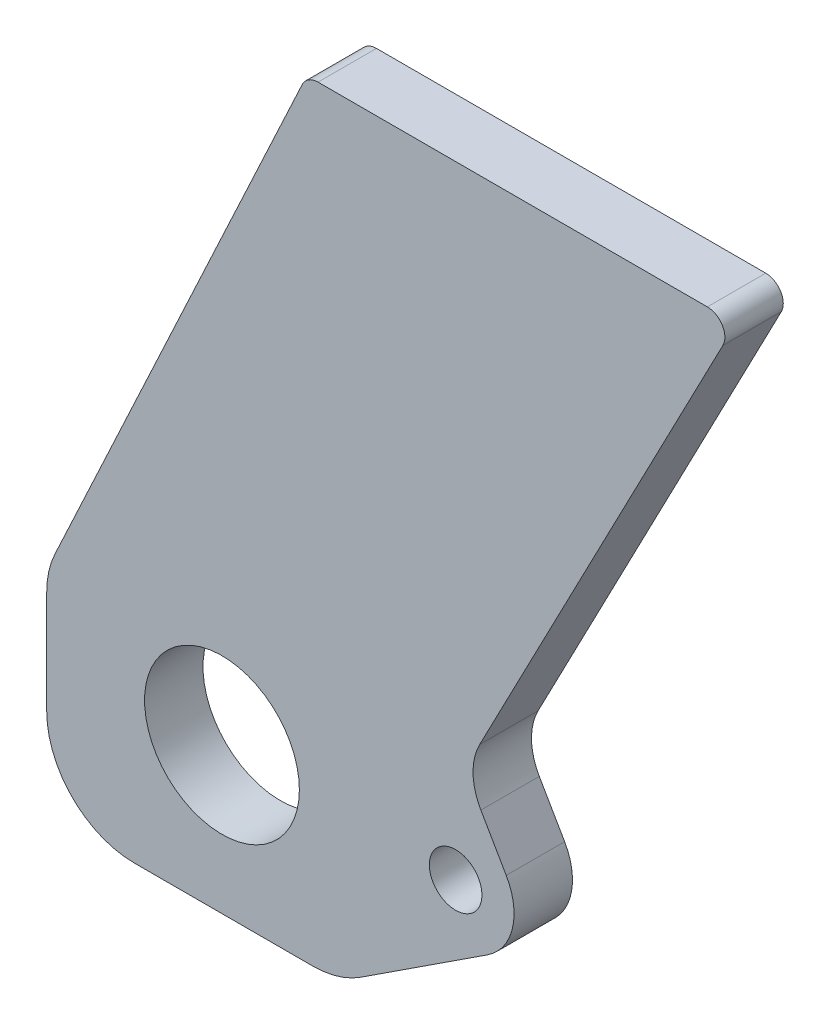
ISO-10303-21;
HEADER;
FILE_DESCRIPTION(('STEP AP214'),'2;1');
FILE_NAME('part.step','',(''),(''),'','','');
FILE_SCHEMA(('AUTOMOTIVE_DESIGN { 1 0 10303 214 1 1 1 1 }'));
ENDSEC;
DATA;
#1=APPLICATION_CONTEXT('core data for automotive mechanical design processes');
#2=APPLICATION_PROTOCOL_DEFINITION('international standard','automotive_design',2000,#1);
#3=PRODUCT_CONTEXT('',#1,'mechanical');
#4=PRODUCT('Part','Part','',(#3));
#5=PRODUCT_RELATED_PRODUCT_CATEGORY('part','',(#4));
#6=PRODUCT_DEFINITION_FORMATION('','',#4);
#7=PRODUCT_DEFINITION_CONTEXT('part definition',#1,'design');
#8=PRODUCT_DEFINITION('design','',#6,#7);
#9=PRODUCT_DEFINITION_SHAPE('','',#8);
#10=(LENGTH_UNIT() NAMED_UNIT(*) SI_UNIT(.MILLI.,.METRE.));
#11=(NAMED_UNIT(*) PLANE_ANGLE_UNIT() SI_UNIT($,.RADIAN.));
#12=(NAMED_UNIT(*) SI_UNIT($,.STERADIAN.) SOLID_ANGLE_UNIT());
#13=UNCERTAINTY_MEASURE_WITH_UNIT(LENGTH_MEASURE(1.E-05),#10,'distance_accuracy_value','');
#14=(GEOMETRIC_REPRESENTATION_CONTEXT(3) GLOBAL_UNCERTAINTY_ASSIGNED_CONTEXT((#13)) GLOBAL_UNIT_ASSIGNED_CONTEXT((#10,
#11,#12)) REPRESENTATION_CONTEXT('',''));
#15=CARTESIAN_POINT('',(0.,0.,0.));
#16=DIRECTION('',(0.,0.,1.));
#17=DIRECTION('',(1.,0.,0.));
#18=AXIS2_PLACEMENT_3D('',#15,#16,#17);
#19=CARTESIAN_POINT('',(40.,0.,10.));
#20=DIRECTION('',(0.,0.,-1.));
#21=DIRECTION('',(-1.,0.,0.));
#22=AXIS2_PLACEMENT_3D('',#19,#20,#21);
#23=PLANE('',#22);
#24=CARTESIAN_POINT('',(0.,0.,10.));
#25=DIRECTION('',(0.,0.,1.));
#26=DIRECTION('',(1.,0.,0.));
#27=AXIS2_PLACEMENT_3D('',#24,#25,#26);
#28=CIRCLE('',#27,13.25);
#29=CARTESIAN_POINT('',(13.25,0.,10.));
#30=VERTEX_POINT('',#29);
#31=EDGE_CURVE('E176',#30,#30,#28,.T.);
#32=ORIENTED_EDGE('',*,*,#31,.F.);
#33=EDGE_LOOP('',(#32));
#34=FACE_BOUND('',#33,.T.);
#35=CARTESIAN_POINT('',(40.,0.,10.));
#36=DIRECTION('',(0.,0.,1.));
#37=DIRECTION('',(-1.,0.,0.));
#38=AXIS2_PLACEMENT_3D('',#35,#36,#37);
#39=CIRCLE('',#38,10.);
#40=CARTESIAN_POINT('',(45.4667835735344,-8.37342685882754,10.));
#41=VERTEX_POINT('',#40);
#42=CARTESIAN_POINT('',(48.6602540378444,4.99999999999998,10.));
#43=VERTEX_POINT('',#42);
#44=EDGE_CURVE('E199',#41,#43,#39,.T.);
#45=ORIENTED_EDGE('',*,*,#44,.T.);
#46=DIRECTION('',(-0.499999999999998,0.86602540378444,0.));
#47=VECTOR('',#46,1.);
#48=CARTESIAN_POINT('',(48.6602540378444,4.99999999999998,10.));
#49=LINE('',#48,#47);
#50=CARTESIAN_POINT('',(44.3224243689384,12.5133413811249,10.));
#51=VERTEX_POINT('',#50);
#52=EDGE_CURVE('E117',#43,#51,#49,.T.);
#53=ORIENTED_EDGE('',*,*,#52,.T.);
#54=CARTESIAN_POINT('',(52.9826784067828,17.5133413811249,10.));
#55=DIRECTION('',(0.,0.,-1.));
#56=DIRECTION('',(1.,0.,0.));
#57=AXIS2_PLACEMENT_3D('',#54,#55,#56);
#58=CIRCLE('',#57,10.);
#59=CARTESIAN_POINT('',(44.1125700750005,22.1308275134752,10.));
#60=VERTEX_POINT('',#59);
#61=EDGE_CURVE('E232',#51,#60,#58,.T.);
#62=ORIENTED_EDGE('',*,*,#61,.T.);
#63=DIRECTION('',(0.461748613235028,0.887010833178225,0.));
#64=VECTOR('',#63,1.);
#65=CARTESIAN_POINT('',(44.1125700750005,22.1308275134752,10.));
#66=LINE('',#65,#64);
#67=CARTESIAN_POINT('',(85.749566861082,102.114754160295,10.));
#68=VERTEX_POINT('',#67);
#69=EDGE_CURVE('E251',#60,#68,#66,.T.);
#70=ORIENTED_EDGE('',*,*,#69,.T.);
#71=CARTESIAN_POINT('',(83.0885343615474,103.5,10.));
#72=DIRECTION('',(0.,0.,1.));
#73=DIRECTION('',(-1.,0.,0.));
#74=AXIS2_PLACEMENT_3D('',#71,#72,#73);
#75=CIRCLE('',#74,3.);
#76=CARTESIAN_POINT('',(83.0885343615474,106.5,10.));
#77=VERTEX_POINT('',#76);
#78=EDGE_CURVE('E248',#68,#77,#75,.T.);
#79=ORIENTED_EDGE('',*,*,#78,.T.);
#80=DIRECTION('',(-1.,0.,0.));
#81=VECTOR('',#80,1.);
#82=CARTESIAN_POINT('',(16.4435921362241,106.5,10.));
#83=LINE('',#82,#81);
#84=CARTESIAN_POINT('',(16.4435921362241,106.5,10.));
#85=VERTEX_POINT('',#84);
#86=EDGE_CURVE('E250',#77,#85,#83,.T.);
#87=ORIENTED_EDGE('',*,*,#86,.T.);
#88=CARTESIAN_POINT('',(16.4435921362241,103.5,10.));
#89=DIRECTION('',(0.,0.,1.));
#90=DIRECTION('',(-1.,0.,0.));
#91=AXIS2_PLACEMENT_3D('',#88,#89,#90);
#92=CIRCLE('',#91,3.);
#93=CARTESIAN_POINT('',(13.7246687751141,104.767854785222,10.));
#94=VERTEX_POINT('',#93);
#95=EDGE_CURVE('E253',#85,#94,#92,.T.);
#96=ORIENTED_EDGE('',*,*,#95,.T.);
#97=DIRECTION('',(-0.422618261740694,-0.906307787036653,0.));
#98=VECTOR('',#97,1.);
#99=CARTESIAN_POINT('',(-28.5946168055498,14.0138539864663,10.));
#100=LINE('',#99,#98);
#101=CARTESIAN_POINT('',(-28.5946168055498,14.0138539864663,10.));
#102=VERTEX_POINT('',#101);
#103=EDGE_CURVE('E259',#94,#102,#100,.T.);
#104=ORIENTED_EDGE('',*,*,#103,.T.);
#105=CARTESIAN_POINT('',(-15.,7.67458006035594,10.));
#106=DIRECTION('',(0.,0.,1.));
#107=DIRECTION('',(1.,0.,0.));
#108=AXIS2_PLACEMENT_3D('',#105,#106,#107);
#109=CIRCLE('',#108,15.);
#110=CARTESIAN_POINT('',(-30.,7.67458006035594,10.));
#111=VERTEX_POINT('',#110);
#112=EDGE_CURVE('E261',#102,#111,#109,.T.);
#113=ORIENTED_EDGE('',*,*,#112,.T.);
#114=DIRECTION('',(0.,-1.,0.));
#115=VECTOR('',#114,1.);
#116=CARTESIAN_POINT('',(-30.,7.67458006035594,10.));
#117=LINE('',#116,#115);
#118=CARTESIAN_POINT('',(-30.,-10.,10.));
#119=VERTEX_POINT('',#118);
#120=EDGE_CURVE('E263',#111,#119,#117,.T.);
#121=ORIENTED_EDGE('',*,*,#120,.T.);
#122=CARTESIAN_POINT('',(-15.,-10.,10.));
#123=DIRECTION('',(0.,0.,1.));
#124=DIRECTION('',(1.,0.,0.));
#125=AXIS2_PLACEMENT_3D('',#122,#123,#124);
#126=CIRCLE('',#125,15.);
#127=CARTESIAN_POINT('',(-15.,-25.,10.));
#128=VERTEX_POINT('',#127);
#129=EDGE_CURVE('E154',#119,#128,#126,.T.);
#130=ORIENTED_EDGE('',*,*,#129,.T.);
#131=DIRECTION('',(1.,0.,0.));
#132=VECTOR('',#131,1.);
#133=CARTESIAN_POINT('',(15.5369374350752,-25.,10.));
#134=LINE('',#133,#132);
#135=CARTESIAN_POINT('',(15.5369374350752,-25.,10.));
#136=VERTEX_POINT('',#135);
#137=EDGE_CURVE('E148',#128,#136,#134,.T.);
#138=ORIENTED_EDGE('',*,*,#137,.T.);
#139=CARTESIAN_POINT('',(15.5369374350753,-9.99999999999999,10.));
#140=DIRECTION('',(0.,0.,1.));
#141=DIRECTION('',(-1.,0.,0.));
#142=AXIS2_PLACEMENT_3D('',#139,#140,#141);
#143=CIRCLE('',#142,15.);
#144=CARTESIAN_POINT('',(23.7371127953769,-22.5601402882413,10.));
#145=VERTEX_POINT('',#144);
#146=EDGE_CURVE('E152',#136,#145,#143,.T.);
#147=ORIENTED_EDGE('',*,*,#146,.T.);
#148=DIRECTION('',(0.837342685882753,0.546678357353441,0.));
#149=VECTOR('',#148,1.);
#150=CARTESIAN_POINT('',(45.4667835735344,-8.37342685882754,10.));
#151=LINE('',#150,#149);
#152=EDGE_CURVE('E56',#145,#41,#151,.T.);
#153=ORIENTED_EDGE('',*,*,#152,.T.);
#154=EDGE_LOOP('',(#45,#53,#62,#70,#79,#87,#96,#104,#113,#121,#130,#138,#147,#153));
#155=FACE_BOUND('',#154,.T.);
#156=CARTESIAN_POINT('',(40.,0.,10.));
#157=DIRECTION('',(0.,0.,1.));
#158=DIRECTION('',(1.,0.,0.));
#159=AXIS2_PLACEMENT_3D('',#156,#157,#158);
#160=CIRCLE('',#159,4.5);
#161=CARTESIAN_POINT('',(44.5,0.,10.));
#162=VERTEX_POINT('',#161);
#163=EDGE_CURVE('E306',#162,#162,#160,.T.);
#164=ORIENTED_EDGE('',*,*,#163,.F.);
#165=EDGE_LOOP('',(#164));
#166=FACE_BOUND('',#165,.T.);
#167=ADVANCED_FACE('F39',(#34,#155,#166),#23,.F.);
#168=CARTESIAN_POINT('',(40.,0.,0.));
#169=DIRECTION('',(0.,0.,-1.));
#170=DIRECTION('',(-1.,0.,0.));
#171=AXIS2_PLACEMENT_3D('',#168,#169,#170);
#172=PLANE('',#171);
#173=CARTESIAN_POINT('',(0.,0.,0.));
#174=DIRECTION('',(0.,0.,1.));
#175=DIRECTION('',(1.,0.,0.));
#176=AXIS2_PLACEMENT_3D('',#173,#174,#175);
#177=CIRCLE('',#176,13.25);
#178=CARTESIAN_POINT('',(13.25,0.,0.));
#179=VERTEX_POINT('',#178);
#180=EDGE_CURVE('E311',#179,#179,#177,.T.);
#181=ORIENTED_EDGE('',*,*,#180,.T.);
#182=EDGE_LOOP('',(#181));
#183=FACE_BOUND('',#182,.T.);
#184=CARTESIAN_POINT('',(40.,0.,0.));
#185=DIRECTION('',(0.,0.,1.));
#186=DIRECTION('',(-1.,0.,0.));
#187=AXIS2_PLACEMENT_3D('',#184,#185,#186);
#188=CIRCLE('',#187,10.);
#189=CARTESIAN_POINT('',(45.4667835735344,-8.37342685882754,0.));
#190=VERTEX_POINT('',#189);
#191=CARTESIAN_POINT('',(48.6602540378444,4.99999999999998,0.));
#192=VERTEX_POINT('',#191);
#193=EDGE_CURVE('E172',#190,#192,#188,.T.);
#194=ORIENTED_EDGE('',*,*,#193,.F.);
#195=DIRECTION('',(0.837342685882753,0.546678357353441,0.));
#196=VECTOR('',#195,1.);
#197=CARTESIAN_POINT('',(45.4667835735344,-8.37342685882754,0.));
#198=LINE('',#197,#196);
#199=CARTESIAN_POINT('',(23.7371127953769,-22.5601402882413,0.));
#200=VERTEX_POINT('',#199);
#201=EDGE_CURVE('E109',#200,#190,#198,.T.);
#202=ORIENTED_EDGE('',*,*,#201,.F.);
#203=CARTESIAN_POINT('',(15.5369374350753,-9.99999999999999,0.));
#204=DIRECTION('',(0.,0.,1.));
#205=DIRECTION('',(-1.,0.,0.));
#206=AXIS2_PLACEMENT_3D('',#203,#204,#205);
#207=CIRCLE('',#206,15.);
#208=CARTESIAN_POINT('',(15.5369374350752,-25.,0.));
#209=VERTEX_POINT('',#208);
#210=EDGE_CURVE('E103',#209,#200,#207,.T.);
#211=ORIENTED_EDGE('',*,*,#210,.F.);
#212=DIRECTION('',(1.,0.,0.));
#213=VECTOR('',#212,1.);
#214=CARTESIAN_POINT('',(15.5369374350752,-25.,0.));
#215=LINE('',#214,#213);
#216=CARTESIAN_POINT('',(-15.,-25.,0.));
#217=VERTEX_POINT('',#216);
#218=EDGE_CURVE('E162',#217,#209,#215,.T.);
#219=ORIENTED_EDGE('',*,*,#218,.F.);
#220=CARTESIAN_POINT('',(-15.,-10.,0.));
#221=DIRECTION('',(0.,0.,1.));
#222=DIRECTION('',(1.,0.,0.));
#223=AXIS2_PLACEMENT_3D('',#220,#221,#222);
#224=CIRCLE('',#223,15.);
#225=CARTESIAN_POINT('',(-30.,-10.,0.));
#226=VERTEX_POINT('',#225);
#227=EDGE_CURVE('E194',#226,#217,#224,.T.);
#228=ORIENTED_EDGE('',*,*,#227,.F.);
#229=DIRECTION('',(0.,-1.,0.));
#230=VECTOR('',#229,1.);
#231=CARTESIAN_POINT('',(-30.,7.67458006035594,0.));
#232=LINE('',#231,#230);
#233=CARTESIAN_POINT('',(-30.,7.67458006035594,0.));
#234=VERTEX_POINT('',#233);
#235=EDGE_CURVE('E192',#234,#226,#232,.T.);
#236=ORIENTED_EDGE('',*,*,#235,.F.);
#237=CARTESIAN_POINT('',(-15.,7.67458006035594,0.));
#238=DIRECTION('',(0.,0.,1.));
#239=DIRECTION('',(1.,0.,0.));
#240=AXIS2_PLACEMENT_3D('',#237,#238,#239);
#241=CIRCLE('',#240,15.);
#242=CARTESIAN_POINT('',(-28.5946168055498,14.0138539864663,0.));
#243=VERTEX_POINT('',#242);
#244=EDGE_CURVE('E190',#243,#234,#241,.T.);
#245=ORIENTED_EDGE('',*,*,#244,.F.);
#246=DIRECTION('',(-0.422618261740694,-0.906307787036653,0.));
#247=VECTOR('',#246,1.);
#248=CARTESIAN_POINT('',(-28.5946168055498,14.0138539864663,0.));
#249=LINE('',#248,#247);
#250=CARTESIAN_POINT('',(13.7246687751141,104.767854785222,0.));
#251=VERTEX_POINT('',#250);
#252=EDGE_CURVE('E188',#251,#243,#249,.T.);
#253=ORIENTED_EDGE('',*,*,#252,.F.);
#254=CARTESIAN_POINT('',(16.4435921362241,103.5,0.));
#255=DIRECTION('',(0.,0.,1.));
#256=DIRECTION('',(-1.,0.,0.));
#257=AXIS2_PLACEMENT_3D('',#254,#255,#256);
#258=CIRCLE('',#257,3.);
#259=CARTESIAN_POINT('',(16.4435921362241,106.5,0.));
#260=VERTEX_POINT('',#259);
#261=EDGE_CURVE('E186',#260,#251,#258,.T.);
#262=ORIENTED_EDGE('',*,*,#261,.F.);
#263=DIRECTION('',(-1.,0.,0.));
#264=VECTOR('',#263,1.);
#265=CARTESIAN_POINT('',(16.4435921362241,106.5,0.));
#266=LINE('',#265,#264);
#267=CARTESIAN_POINT('',(83.0885343615474,106.5,0.));
#268=VERTEX_POINT('',#267);
#269=EDGE_CURVE('E184',#268,#260,#266,.T.);
#270=ORIENTED_EDGE('',*,*,#269,.F.);
#271=CARTESIAN_POINT('',(83.0885343615474,103.5,0.));
#272=DIRECTION('',(0.,0.,1.));
#273=DIRECTION('',(-1.,0.,0.));
#274=AXIS2_PLACEMENT_3D('',#271,#272,#273);
#275=CIRCLE('',#274,3.);
#276=CARTESIAN_POINT('',(85.749566861082,102.114754160295,0.));
#277=VERTEX_POINT('',#276);
#278=EDGE_CURVE('E182',#277,#268,#275,.T.);
#279=ORIENTED_EDGE('',*,*,#278,.F.);
#280=DIRECTION('',(0.461748613235028,0.887010833178225,0.));
#281=VECTOR('',#280,1.);
#282=CARTESIAN_POINT('',(44.1125700750005,22.1308275134752,0.));
#283=LINE('',#282,#281);
#284=CARTESIAN_POINT('',(44.1125700750005,22.1308275134752,0.));
#285=VERTEX_POINT('',#284);
#286=EDGE_CURVE('E180',#285,#277,#283,.T.);
#287=ORIENTED_EDGE('',*,*,#286,.F.);
#288=CARTESIAN_POINT('',(52.9826784067828,17.5133413811249,0.));
#289=DIRECTION('',(0.,0.,-1.));
#290=DIRECTION('',(1.,0.,0.));
#291=AXIS2_PLACEMENT_3D('',#288,#289,#290);
#292=CIRCLE('',#291,10.);
#293=CARTESIAN_POINT('',(44.3224243689384,12.5133413811249,0.));
#294=VERTEX_POINT('',#293);
#295=EDGE_CURVE('E178',#294,#285,#292,.T.);
#296=ORIENTED_EDGE('',*,*,#295,.F.);
#297=DIRECTION('',(-0.499999999999998,0.86602540378444,0.));
#298=VECTOR('',#297,1.);
#299=CARTESIAN_POINT('',(48.6602540378444,4.99999999999998,0.));
#300=LINE('',#299,#298);
#301=EDGE_CURVE('E175',#192,#294,#300,.T.);
#302=ORIENTED_EDGE('',*,*,#301,.F.);
#303=EDGE_LOOP('',(#194,#202,#211,#219,#228,#236,#245,#253,#262,#270,#279,#287,#296,#302));
#304=FACE_BOUND('',#303,.T.);
#305=CARTESIAN_POINT('',(40.,0.,0.));
#306=DIRECTION('',(0.,0.,1.));
#307=DIRECTION('',(1.,0.,0.));
#308=AXIS2_PLACEMENT_3D('',#305,#306,#307);
#309=CIRCLE('',#308,4.5);
#310=CARTESIAN_POINT('',(44.5,0.,0.));
#311=VERTEX_POINT('',#310);
#312=EDGE_CURVE('E309',#311,#311,#309,.T.);
#313=ORIENTED_EDGE('',*,*,#312,.T.);
#314=EDGE_LOOP('',(#313));
#315=FACE_BOUND('',#314,.T.);
#316=ADVANCED_FACE('F236',(#183,#304,#315),#172,.T.);
#317=CARTESIAN_POINT('',(40.,0.,10.));
#318=DIRECTION('',(0.,0.,-1.));
#319=DIRECTION('',(-1.,0.,0.));
#320=AXIS2_PLACEMENT_3D('',#317,#318,#319);
#321=CYLINDRICAL_SURFACE('',#320,10.);
#322=ORIENTED_EDGE('',*,*,#193,.T.);
#323=DIRECTION('',(0.,0.,-1.));
#324=VECTOR('',#323,1.);
#325=CARTESIAN_POINT('',(48.6602540378444,4.99999999999998,10.));
#326=LINE('',#325,#324);
#327=EDGE_CURVE('E11',#43,#192,#326,.T.);
#328=ORIENTED_EDGE('',*,*,#327,.F.);
#329=ORIENTED_EDGE('',*,*,#44,.F.);
#330=DIRECTION('',(0.,0.,-1.));
#331=VECTOR('',#330,1.);
#332=CARTESIAN_POINT('',(45.4667835735344,-8.37342685882754,10.));
#333=LINE('',#332,#331);
#334=EDGE_CURVE('E168',#41,#190,#333,.T.);
#335=ORIENTED_EDGE('',*,*,#334,.T.);
#336=EDGE_LOOP('',(#322,#328,#329,#335));
#337=FACE_BOUND('',#336,.T.);
#338=ADVANCED_FACE('F41',(#337),#321,.T.);
#339=CARTESIAN_POINT('',(48.6602540378444,4.99999999999998,10.));
#340=DIRECTION('',(-0.86602540378444,-0.499999999999998,0.));
#341=DIRECTION('',(0.499999999999998,-0.86602540378444,0.));
#342=AXIS2_PLACEMENT_3D('',#339,#340,#341);
#343=PLANE('',#342);
#344=ORIENTED_EDGE('',*,*,#301,.T.);
#345=DIRECTION('',(0.,0.,-1.));
#346=VECTOR('',#345,1.);
#347=CARTESIAN_POINT('',(44.3224243689384,12.5133413811249,10.));
#348=LINE('',#347,#346);
#349=EDGE_CURVE('E48',#51,#294,#348,.T.);
#350=ORIENTED_EDGE('',*,*,#349,.F.);
#351=ORIENTED_EDGE('',*,*,#52,.F.);
#352=ORIENTED_EDGE('',*,*,#327,.T.);
#353=EDGE_LOOP('',(#344,#350,#351,#352));
#354=FACE_BOUND('',#353,.T.);
#355=ADVANCED_FACE('F400',(#354),#343,.F.);
#356=CARTESIAN_POINT('',(52.9826784067828,17.5133413811249,10.));
#357=DIRECTION('',(0.,0.,-1.));
#358=DIRECTION('',(-1.,0.,0.));
#359=AXIS2_PLACEMENT_3D('',#356,#357,#358);
#360=CYLINDRICAL_SURFACE('',#359,10.);
#361=ORIENTED_EDGE('',*,*,#295,.T.);
#362=DIRECTION('',(0.,0.,-1.));
#363=VECTOR('',#362,1.);
#364=CARTESIAN_POINT('',(44.1125700750005,22.1308275134752,10.));
#365=LINE('',#364,#363);
#366=EDGE_CURVE('E224',#60,#285,#365,.T.);
#367=ORIENTED_EDGE('',*,*,#366,.F.);
#368=ORIENTED_EDGE('',*,*,#61,.F.);
#369=ORIENTED_EDGE('',*,*,#349,.T.);
#370=EDGE_LOOP('',(#361,#367,#368,#369));
#371=FACE_BOUND('',#370,.T.);
#372=ADVANCED_FACE('F230',(#371),#360,.F.);
#373=CARTESIAN_POINT('',(44.1125700750005,22.1308275134752,10.));
#374=DIRECTION('',(-0.887010833178225,0.461748613235028,0.));
#375=DIRECTION('',(-0.461748613235028,-0.887010833178225,0.));
#376=AXIS2_PLACEMENT_3D('',#373,#374,#375);
#377=PLANE('',#376);
#378=ORIENTED_EDGE('',*,*,#286,.T.);
#379=DIRECTION('',(0.,0.,-1.));
#380=VECTOR('',#379,1.);
#381=CARTESIAN_POINT('',(85.749566861082,102.114754160295,10.));
#382=LINE('',#381,#380);
#383=EDGE_CURVE('E221',#68,#277,#382,.T.);
#384=ORIENTED_EDGE('',*,*,#383,.F.);
#385=ORIENTED_EDGE('',*,*,#69,.F.);
#386=ORIENTED_EDGE('',*,*,#366,.T.);
#387=EDGE_LOOP('',(#378,#384,#385,#386));
#388=FACE_BOUND('',#387,.T.);
#389=ADVANCED_FACE('F242',(#388),#377,.F.);
#390=CARTESIAN_POINT('',(83.0885343615474,103.5,10.));
#391=DIRECTION('',(0.,0.,-1.));
#392=DIRECTION('',(-1.,0.,0.));
#393=AXIS2_PLACEMENT_3D('',#390,#391,#392);
#394=CYLINDRICAL_SURFACE('',#393,3.);
#395=ORIENTED_EDGE('',*,*,#278,.T.);
#396=DIRECTION('',(0.,0.,-1.));
#397=VECTOR('',#396,1.);
#398=CARTESIAN_POINT('',(83.0885343615474,106.5,10.));
#399=LINE('',#398,#397);
#400=EDGE_CURVE('E218',#77,#268,#399,.T.);
#401=ORIENTED_EDGE('',*,*,#400,.F.);
#402=ORIENTED_EDGE('',*,*,#78,.F.);
#403=ORIENTED_EDGE('',*,*,#383,.T.);
#404=EDGE_LOOP('',(#395,#401,#402,#403));
#405=FACE_BOUND('',#404,.T.);
#406=ADVANCED_FACE('F246',(#405),#394,.T.);
#407=CARTESIAN_POINT('',(16.4435921362241,106.5,10.));
#408=DIRECTION('',(0.,-1.,0.));
#409=DIRECTION('',(0.,0.,-1.));
#410=AXIS2_PLACEMENT_3D('',#407,#408,#409);
#411=PLANE('',#410);
#412=ORIENTED_EDGE('',*,*,#269,.T.);
#413=DIRECTION('',(0.,0.,-1.));
#414=VECTOR('',#413,1.);
#415=CARTESIAN_POINT('',(16.4435921362241,106.5,10.));
#416=LINE('',#415,#414);
#417=EDGE_CURVE('E215',#85,#260,#416,.T.);
#418=ORIENTED_EDGE('',*,*,#417,.F.);
#419=ORIENTED_EDGE('',*,*,#86,.F.);
#420=ORIENTED_EDGE('',*,*,#400,.T.);
#421=EDGE_LOOP('',(#412,#418,#419,#420));
#422=FACE_BOUND('',#421,.T.);
#423=ADVANCED_FACE('F373',(#422),#411,.F.);
#424=CARTESIAN_POINT('',(16.4435921362241,103.5,10.));
#425=DIRECTION('',(0.,0.,-1.));
#426=DIRECTION('',(-1.,0.,0.));
#427=AXIS2_PLACEMENT_3D('',#424,#425,#426);
#428=CYLINDRICAL_SURFACE('',#427,3.);
#429=ORIENTED_EDGE('',*,*,#261,.T.);
#430=DIRECTION('',(0.,0.,-1.));
#431=VECTOR('',#430,1.);
#432=CARTESIAN_POINT('',(13.7246687751141,104.767854785222,10.));
#433=LINE('',#432,#431);
#434=EDGE_CURVE('E212',#94,#251,#433,.T.);
#435=ORIENTED_EDGE('',*,*,#434,.F.);
#436=ORIENTED_EDGE('',*,*,#95,.F.);
#437=ORIENTED_EDGE('',*,*,#417,.T.);
#438=EDGE_LOOP('',(#429,#435,#436,#437));
#439=FACE_BOUND('',#438,.T.);
#440=ADVANCED_FACE('F365',(#439),#428,.T.);
#441=CARTESIAN_POINT('',(-28.5946168055498,14.0138539864663,10.));
#442=DIRECTION('',(0.906307787036653,-0.422618261740694,0.));
#443=DIRECTION('',(0.422618261740694,0.906307787036653,0.));
#444=AXIS2_PLACEMENT_3D('',#441,#442,#443);
#445=PLANE('',#444);
#446=ORIENTED_EDGE('',*,*,#252,.T.);
#447=DIRECTION('',(0.,0.,-1.));
#448=VECTOR('',#447,1.);
#449=CARTESIAN_POINT('',(-28.5946168055498,14.0138539864663,10.));
#450=LINE('',#449,#448);
#451=EDGE_CURVE('E209',#102,#243,#450,.T.);
#452=ORIENTED_EDGE('',*,*,#451,.F.);
#453=ORIENTED_EDGE('',*,*,#103,.F.);
#454=ORIENTED_EDGE('',*,*,#434,.T.);
#455=EDGE_LOOP('',(#446,#452,#453,#454));
#456=FACE_BOUND('',#455,.T.);
#457=ADVANCED_FACE('F357',(#456),#445,.F.);
#458=CARTESIAN_POINT('',(-15.,7.67458006035594,10.));
#459=DIRECTION('',(0.,0.,-1.));
#460=DIRECTION('',(-1.,0.,0.));
#461=AXIS2_PLACEMENT_3D('',#458,#459,#460);
#462=CYLINDRICAL_SURFACE('',#461,15.);
#463=ORIENTED_EDGE('',*,*,#244,.T.);
#464=DIRECTION('',(0.,0.,-1.));
#465=VECTOR('',#464,1.);
#466=CARTESIAN_POINT('',(-30.,7.67458006035594,10.));
#467=LINE('',#466,#465);
#468=EDGE_CURVE('E206',#111,#234,#467,.T.);
#469=ORIENTED_EDGE('',*,*,#468,.F.);
#470=ORIENTED_EDGE('',*,*,#112,.F.);
#471=ORIENTED_EDGE('',*,*,#451,.T.);
#472=EDGE_LOOP('',(#463,#469,#470,#471));
#473=FACE_BOUND('',#472,.T.);
#474=ADVANCED_FACE('F350',(#473),#462,.T.);
#475=CARTESIAN_POINT('',(-30.,7.67458006035594,10.));
#476=DIRECTION('',(1.,0.,0.));
#477=DIRECTION('',(0.,0.,-1.));
#478=AXIS2_PLACEMENT_3D('',#475,#476,#477);
#479=PLANE('',#478);
#480=ORIENTED_EDGE('',*,*,#235,.T.);
#481=DIRECTION('',(0.,0.,-1.));
#482=VECTOR('',#481,1.);
#483=CARTESIAN_POINT('',(-30.,-10.,10.));
#484=LINE('',#483,#482);
#485=EDGE_CURVE('E203',#119,#226,#484,.T.);
#486=ORIENTED_EDGE('',*,*,#485,.F.);
#487=ORIENTED_EDGE('',*,*,#120,.F.);
#488=ORIENTED_EDGE('',*,*,#468,.T.);
#489=EDGE_LOOP('',(#480,#486,#487,#488));
#490=FACE_BOUND('',#489,.T.);
#491=ADVANCED_FACE('F269',(#490),#479,.F.);
#492=CARTESIAN_POINT('',(-15.,-10.,10.));
#493=DIRECTION('',(0.,0.,-1.));
#494=DIRECTION('',(-1.,0.,0.));
#495=AXIS2_PLACEMENT_3D('',#492,#493,#494);
#496=CYLINDRICAL_SURFACE('',#495,15.);
#497=ORIENTED_EDGE('',*,*,#227,.T.);
#498=DIRECTION('',(0.,0.,-1.));
#499=VECTOR('',#498,1.);
#500=CARTESIAN_POINT('',(-15.,-25.,10.));
#501=LINE('',#500,#499);
#502=EDGE_CURVE('E163',#128,#217,#501,.T.);
#503=ORIENTED_EDGE('',*,*,#502,.F.);
#504=ORIENTED_EDGE('',*,*,#129,.F.);
#505=ORIENTED_EDGE('',*,*,#485,.T.);
#506=EDGE_LOOP('',(#497,#503,#504,#505));
#507=FACE_BOUND('',#506,.T.);
#508=ADVANCED_FACE('F273',(#507),#496,.T.);
#509=CARTESIAN_POINT('',(15.5369374350752,-25.,10.));
#510=DIRECTION('',(0.,1.,0.));
#511=DIRECTION('',(-1.,0.,0.));
#512=AXIS2_PLACEMENT_3D('',#509,#510,#511);
#513=PLANE('',#512);
#514=ORIENTED_EDGE('',*,*,#218,.T.);
#515=DIRECTION('',(0.,0.,-1.));
#516=VECTOR('',#515,1.);
#517=CARTESIAN_POINT('',(15.5369374350752,-25.,10.));
#518=LINE('',#517,#516);
#519=EDGE_CURVE('E159',#136,#209,#518,.T.);
#520=ORIENTED_EDGE('',*,*,#519,.F.);
#521=ORIENTED_EDGE('',*,*,#137,.F.);
#522=ORIENTED_EDGE('',*,*,#502,.T.);
#523=EDGE_LOOP('',(#514,#520,#521,#522));
#524=FACE_BOUND('',#523,.T.);
#525=ADVANCED_FACE('F160',(#524),#513,.F.);
#526=CARTESIAN_POINT('',(15.5369374350753,-9.99999999999999,10.));
#527=DIRECTION('',(0.,0.,-1.));
#528=DIRECTION('',(-1.,0.,0.));
#529=AXIS2_PLACEMENT_3D('',#526,#527,#528);
#530=CYLINDRICAL_SURFACE('',#529,15.);
#531=ORIENTED_EDGE('',*,*,#210,.T.);
#532=DIRECTION('',(0.,0.,-1.));
#533=VECTOR('',#532,1.);
#534=CARTESIAN_POINT('',(23.7371127953769,-22.5601402882413,10.));
#535=LINE('',#534,#533);
#536=EDGE_CURVE('E164',#145,#200,#535,.T.);
#537=ORIENTED_EDGE('',*,*,#536,.F.);
#538=ORIENTED_EDGE('',*,*,#146,.F.);
#539=ORIENTED_EDGE('',*,*,#519,.T.);
#540=EDGE_LOOP('',(#531,#537,#538,#539));
#541=FACE_BOUND('',#540,.T.);
#542=ADVANCED_FACE('F166',(#541),#530,.T.);
#543=CARTESIAN_POINT('',(45.4667835735344,-8.37342685882754,10.));
#544=DIRECTION('',(-0.546678357353441,0.837342685882753,0.));
#545=DIRECTION('',(-0.837342685882753,-0.546678357353441,0.));
#546=AXIS2_PLACEMENT_3D('',#543,#544,#545);
#547=PLANE('',#546);
#548=ORIENTED_EDGE('',*,*,#201,.T.);
#549=ORIENTED_EDGE('',*,*,#334,.F.);
#550=ORIENTED_EDGE('',*,*,#152,.F.);
#551=ORIENTED_EDGE('',*,*,#536,.T.);
#552=EDGE_LOOP('',(#548,#549,#550,#551));
#553=FACE_BOUND('',#552,.T.);
#554=ADVANCED_FACE('F277',(#553),#547,.F.);
#555=CARTESIAN_POINT('',(0.,0.,10.));
#556=DIRECTION('',(0.,0.,-1.));
#557=DIRECTION('',(-1.,0.,0.));
#558=AXIS2_PLACEMENT_3D('',#555,#556,#557);
#559=CYLINDRICAL_SURFACE('',#558,13.25);
#560=ORIENTED_EDGE('',*,*,#31,.T.);
#561=EDGE_LOOP('',(#560));
#562=FACE_BOUND('',#561,.T.);
#563=ORIENTED_EDGE('',*,*,#180,.F.);
#564=EDGE_LOOP('',(#563));
#565=FACE_BOUND('',#564,.T.);
#566=ADVANCED_FACE('F279',(#562,#565),#559,.F.);
#567=CARTESIAN_POINT('',(40.,0.,10.));
#568=DIRECTION('',(0.,0.,-1.));
#569=DIRECTION('',(-1.,0.,0.));
#570=AXIS2_PLACEMENT_3D('',#567,#568,#569);
#571=CYLINDRICAL_SURFACE('',#570,4.5);
#572=ORIENTED_EDGE('',*,*,#163,.T.);
#573=EDGE_LOOP('',(#572));
#574=FACE_BOUND('',#573,.T.);
#575=ORIENTED_EDGE('',*,*,#312,.F.);
#576=EDGE_LOOP('',(#575));
#577=FACE_BOUND('',#576,.T.);
#578=ADVANCED_FACE('F285',(#574,#577),#571,.F.);
#579=CLOSED_SHELL('',(#167,#316,#338,#355,#372,#389,#406,#423,#440,#457,#474,#491,#508,#525,
#542,#554,#566,#578));
#580=MANIFOLD_SOLID_BREP('B2',#579);
#581=ADVANCED_BREP_SHAPE_REPRESENTATION('',(#18,#580),#14);
#582=SHAPE_DEFINITION_REPRESENTATION(#9,#581);
ENDSEC;
END-ISO-10303-21;
